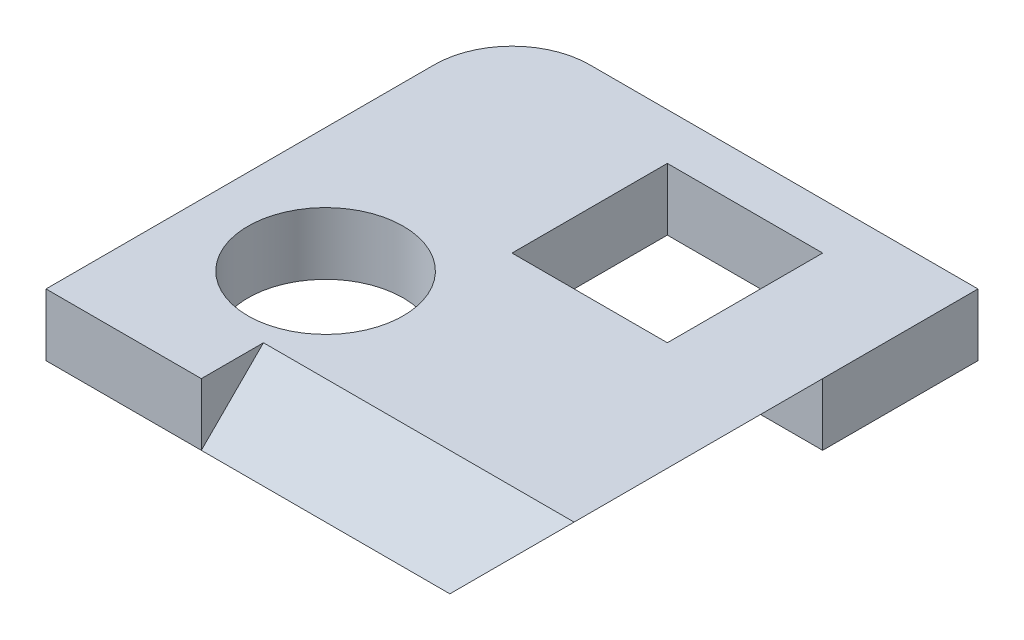
ISO-10303-21;
HEADER;
FILE_DESCRIPTION(('STEP AP214'),'2;1');
FILE_NAME('part.step','',(''),(''),'','','');
FILE_SCHEMA(('AUTOMOTIVE_DESIGN { 1 0 10303 214 1 1 1 1 }'));
ENDSEC;
DATA;
#1=APPLICATION_CONTEXT('core data for automotive mechanical design processes');
#2=APPLICATION_PROTOCOL_DEFINITION('international standard','automotive_design',2000,#1);
#3=PRODUCT_CONTEXT('',#1,'mechanical');
#4=PRODUCT('Part','Part','',(#3));
#5=PRODUCT_RELATED_PRODUCT_CATEGORY('part','',(#4));
#6=PRODUCT_DEFINITION_FORMATION('','',#4);
#7=PRODUCT_DEFINITION_CONTEXT('part definition',#1,'design');
#8=PRODUCT_DEFINITION('design','',#6,#7);
#9=PRODUCT_DEFINITION_SHAPE('','',#8);
#10=(LENGTH_UNIT() NAMED_UNIT(*) SI_UNIT(.MILLI.,.METRE.));
#11=(NAMED_UNIT(*) PLANE_ANGLE_UNIT() SI_UNIT($,.RADIAN.));
#12=(NAMED_UNIT(*) SI_UNIT($,.STERADIAN.) SOLID_ANGLE_UNIT());
#13=UNCERTAINTY_MEASURE_WITH_UNIT(LENGTH_MEASURE(1.E-05),#10,'distance_accuracy_value','');
#14=(GEOMETRIC_REPRESENTATION_CONTEXT(3) GLOBAL_UNCERTAINTY_ASSIGNED_CONTEXT((#13)) GLOBAL_UNIT_ASSIGNED_CONTEXT((#10,
#11,#12)) REPRESENTATION_CONTEXT('',''));
#15=CARTESIAN_POINT('',(0.,0.,0.));
#16=DIRECTION('',(0.,0.,1.));
#17=DIRECTION('',(1.,0.,0.));
#18=AXIS2_PLACEMENT_3D('',#15,#16,#17);
#19=CARTESIAN_POINT('',(0.,4.,0.));
#20=DIRECTION('',(1.,0.,0.));
#21=DIRECTION('',(0.,0.,-1.));
#22=AXIS2_PLACEMENT_3D('',#19,#20,#21);
#23=PLANE('',#22);
#24=DIRECTION('',(0.,0.,1.));
#25=VECTOR('',#24,1.);
#26=CARTESIAN_POINT('',(0.,4.,0.));
#27=LINE('',#26,#25);
#28=CARTESIAN_POINT('',(0.,4.,-25.));
#29=VERTEX_POINT('',#28);
#30=CARTESIAN_POINT('',(0.,4.,0.));
#31=VERTEX_POINT('',#30);
#32=EDGE_CURVE('E173',#29,#31,#27,.T.);
#33=ORIENTED_EDGE('',*,*,#32,.F.);
#34=DIRECTION('',(0.,-1.,0.));
#35=VECTOR('',#34,1.);
#36=CARTESIAN_POINT('',(0.,4.,-25.));
#37=LINE('',#36,#35);
#38=CARTESIAN_POINT('',(0.,0.,-25.));
#39=VERTEX_POINT('',#38);
#40=EDGE_CURVE('E178',#29,#39,#37,.T.);
#41=ORIENTED_EDGE('',*,*,#40,.T.);
#42=DIRECTION('',(0.,0.,1.));
#43=VECTOR('',#42,1.);
#44=CARTESIAN_POINT('',(0.,0.,0.));
#45=LINE('',#44,#43);
#46=CARTESIAN_POINT('',(0.,0.,0.));
#47=VERTEX_POINT('',#46);
#48=EDGE_CURVE('E163',#39,#47,#45,.T.);
#49=ORIENTED_EDGE('',*,*,#48,.T.);
#50=DIRECTION('',(0.,-1.,0.));
#51=VECTOR('',#50,1.);
#52=CARTESIAN_POINT('',(0.,4.,0.));
#53=LINE('',#52,#51);
#54=EDGE_CURVE('E175',#31,#47,#53,.T.);
#55=ORIENTED_EDGE('',*,*,#54,.F.);
#56=EDGE_LOOP('',(#33,#41,#49,#55));
#57=FACE_BOUND('',#56,.T.);
#58=ADVANCED_FACE('F37',(#57),#23,.F.);
#59=CARTESIAN_POINT('',(0.,4.,0.));
#60=DIRECTION('',(0.,0.,-1.));
#61=DIRECTION('',(-1.,0.,0.));
#62=AXIS2_PLACEMENT_3D('',#59,#60,#61);
#63=PLANE('',#62);
#64=DIRECTION('',(1.,0.,0.));
#65=VECTOR('',#64,1.);
#66=CARTESIAN_POINT('',(0.,0.,0.));
#67=LINE('',#66,#65);
#68=CARTESIAN_POINT('',(10.,0.,0.));
#69=VERTEX_POINT('',#68);
#70=EDGE_CURVE('E165',#47,#69,#67,.T.);
#71=ORIENTED_EDGE('',*,*,#70,.T.);
#72=DIRECTION('',(0.,-1.,0.));
#73=VECTOR('',#72,1.);
#74=CARTESIAN_POINT('',(10.,4.,0.));
#75=LINE('',#74,#73);
#76=CARTESIAN_POINT('',(10.,4.,0.));
#77=VERTEX_POINT('',#76);
#78=EDGE_CURVE('E52',#77,#69,#75,.T.);
#79=ORIENTED_EDGE('',*,*,#78,.F.);
#80=DIRECTION('',(1.,0.,0.));
#81=VECTOR('',#80,1.);
#82=CARTESIAN_POINT('',(0.,4.,0.));
#83=LINE('',#82,#81);
#84=EDGE_CURVE('E152',#31,#77,#83,.T.);
#85=ORIENTED_EDGE('',*,*,#84,.F.);
#86=ORIENTED_EDGE('',*,*,#54,.T.);
#87=EDGE_LOOP('',(#71,#79,#85,#86));
#88=FACE_BOUND('',#87,.T.);
#89=ADVANCED_FACE('F206',(#88),#63,.F.);
#90=CARTESIAN_POINT('',(30.,4.,0.));
#91=DIRECTION('',(-1.,0.,0.));
#92=DIRECTION('',(0.,0.,1.));
#93=AXIS2_PLACEMENT_3D('',#90,#91,#92);
#94=PLANE('',#93);
#95=DIRECTION('',(0.,0.,-1.));
#96=VECTOR('',#95,1.);
#97=CARTESIAN_POINT('',(30.,4.,0.));
#98=LINE('',#97,#96);
#99=CARTESIAN_POINT('',(30.,4.,-20.));
#100=VERTEX_POINT('',#99);
#101=CARTESIAN_POINT('',(30.,4.,-30.));
#102=VERTEX_POINT('',#101);
#103=EDGE_CURVE('E147',#100,#102,#98,.T.);
#104=ORIENTED_EDGE('',*,*,#103,.F.);
#105=DIRECTION('',(0.,1.,0.));
#106=VECTOR('',#105,1.);
#107=CARTESIAN_POINT('',(30.,0.,-20.));
#108=LINE('',#107,#106);
#109=CARTESIAN_POINT('',(30.,0.,-20.));
#110=VERTEX_POINT('',#109);
#111=EDGE_CURVE('E138',#110,#100,#108,.T.);
#112=ORIENTED_EDGE('',*,*,#111,.F.);
#113=DIRECTION('',(0.,0.,-1.));
#114=VECTOR('',#113,1.);
#115=CARTESIAN_POINT('',(30.,0.,0.));
#116=LINE('',#115,#114);
#117=CARTESIAN_POINT('',(30.,0.,-30.));
#118=VERTEX_POINT('',#117);
#119=EDGE_CURVE('E169',#110,#118,#116,.T.);
#120=ORIENTED_EDGE('',*,*,#119,.T.);
#121=DIRECTION('',(0.,-1.,0.));
#122=VECTOR('',#121,1.);
#123=CARTESIAN_POINT('',(30.,4.,-30.));
#124=LINE('',#123,#122);
#125=EDGE_CURVE('E150',#102,#118,#124,.T.);
#126=ORIENTED_EDGE('',*,*,#125,.F.);
#127=EDGE_LOOP('',(#104,#112,#120,#126));
#128=FACE_BOUND('',#127,.T.);
#129=ADVANCED_FACE('F148',(#128),#94,.F.);
#130=CARTESIAN_POINT('',(0.,4.,-30.));
#131=DIRECTION('',(0.,0.,1.));
#132=DIRECTION('',(1.,0.,0.));
#133=AXIS2_PLACEMENT_3D('',#130,#131,#132);
#134=PLANE('',#133);
#135=DIRECTION('',(-1.,0.,0.));
#136=VECTOR('',#135,1.);
#137=CARTESIAN_POINT('',(0.,0.,-30.));
#138=LINE('',#137,#136);
#139=CARTESIAN_POINT('',(5.,0.,-30.));
#140=VERTEX_POINT('',#139);
#141=EDGE_CURVE('E171',#118,#140,#138,.T.);
#142=ORIENTED_EDGE('',*,*,#141,.T.);
#143=DIRECTION('',(0.,-1.,0.));
#144=VECTOR('',#143,1.);
#145=CARTESIAN_POINT('',(5.,4.,-30.));
#146=LINE('',#145,#144);
#147=CARTESIAN_POINT('',(5.,4.,-30.));
#148=VERTEX_POINT('',#147);
#149=EDGE_CURVE('E60',#140,#148,#146,.F.);
#150=ORIENTED_EDGE('',*,*,#149,.T.);
#151=DIRECTION('',(-1.,0.,0.));
#152=VECTOR('',#151,1.);
#153=CARTESIAN_POINT('',(0.,4.,-30.));
#154=LINE('',#153,#152);
#155=EDGE_CURVE('E158',#102,#148,#154,.T.);
#156=ORIENTED_EDGE('',*,*,#155,.F.);
#157=ORIENTED_EDGE('',*,*,#125,.T.);
#158=EDGE_LOOP('',(#142,#150,#156,#157));
#159=FACE_BOUND('',#158,.T.);
#160=ADVANCED_FACE('F197',(#159),#134,.F.);
#161=CARTESIAN_POINT('',(0.,4.,0.));
#162=DIRECTION('',(0.,-1.,0.));
#163=DIRECTION('',(0.,0.,-1.));
#164=AXIS2_PLACEMENT_3D('',#161,#162,#163);
#165=PLANE('',#164);
#166=CARTESIAN_POINT('',(8.,4.,-10.));
#167=DIRECTION('',(0.,1.,0.));
#168=DIRECTION('',(0.,0.,1.));
#169=AXIS2_PLACEMENT_3D('',#166,#167,#168);
#170=CIRCLE('',#169,5.);
#171=CARTESIAN_POINT('',(8.,4.,-5.));
#172=VERTEX_POINT('',#171);
#173=EDGE_CURVE('E224',#172,#172,#170,.T.);
#174=ORIENTED_EDGE('',*,*,#173,.F.);
#175=EDGE_LOOP('',(#174));
#176=FACE_BOUND('',#175,.T.);
#177=DIRECTION('',(1.,0.,0.));
#178=VECTOR('',#177,1.);
#179=CARTESIAN_POINT('',(13.,4.,-17.));
#180=LINE('',#179,#178);
#181=CARTESIAN_POINT('',(13.,4.,-17.));
#182=VERTEX_POINT('',#181);
#183=CARTESIAN_POINT('',(23.,4.,-17.));
#184=VERTEX_POINT('',#183);
#185=EDGE_CURVE('E250',#182,#184,#180,.T.);
#186=ORIENTED_EDGE('',*,*,#185,.F.);
#187=DIRECTION('',(0.,0.,1.));
#188=VECTOR('',#187,1.);
#189=CARTESIAN_POINT('',(13.,4.,-27.));
#190=LINE('',#189,#188);
#191=CARTESIAN_POINT('',(13.,4.,-27.));
#192=VERTEX_POINT('',#191);
#193=EDGE_CURVE('E232',#192,#182,#190,.T.);
#194=ORIENTED_EDGE('',*,*,#193,.F.);
#195=DIRECTION('',(-1.,0.,0.));
#196=VECTOR('',#195,1.);
#197=CARTESIAN_POINT('',(13.,4.,-27.));
#198=LINE('',#197,#196);
#199=CARTESIAN_POINT('',(23.,4.,-27.));
#200=VERTEX_POINT('',#199);
#201=EDGE_CURVE('E239',#200,#192,#198,.T.);
#202=ORIENTED_EDGE('',*,*,#201,.F.);
#203=DIRECTION('',(0.,0.,-1.));
#204=VECTOR('',#203,1.);
#205=CARTESIAN_POINT('',(23.,4.,-27.));
#206=LINE('',#205,#204);
#207=EDGE_CURVE('E253',#184,#200,#206,.T.);
#208=ORIENTED_EDGE('',*,*,#207,.F.);
#209=EDGE_LOOP('',(#186,#194,#202,#208));
#210=FACE_BOUND('',#209,.T.);
#211=DIRECTION('',(0.,0.,1.));
#212=VECTOR('',#211,1.);
#213=CARTESIAN_POINT('',(10.,4.,-3.99999999999998));
#214=LINE('',#213,#212);
#215=CARTESIAN_POINT('',(10.,4.,-3.99999999999998));
#216=VERTEX_POINT('',#215);
#217=EDGE_CURVE('E221',#216,#77,#214,.T.);
#218=ORIENTED_EDGE('',*,*,#217,.F.);
#219=DIRECTION('',(1.,0.,0.));
#220=VECTOR('',#219,1.);
#221=CARTESIAN_POINT('',(10.,4.,-3.99999999999998));
#222=LINE('',#221,#220);
#223=CARTESIAN_POINT('',(30.,4.,-3.99999999999998));
#224=VERTEX_POINT('',#223);
#225=EDGE_CURVE('E157',#216,#224,#222,.T.);
#226=ORIENTED_EDGE('',*,*,#225,.T.);
#227=EDGE_CURVE('E132',#224,#100,#98,.T.);
#228=ORIENTED_EDGE('',*,*,#227,.T.);
#229=ORIENTED_EDGE('',*,*,#103,.T.);
#230=ORIENTED_EDGE('',*,*,#155,.T.);
#231=CARTESIAN_POINT('',(5.,4.,-25.));
#232=DIRECTION('',(0.,-1.,0.));
#233=DIRECTION('',(0.,0.,-1.));
#234=AXIS2_PLACEMENT_3D('',#231,#232,#233);
#235=CIRCLE('',#234,5.);
#236=EDGE_CURVE('E45',#148,#29,#235,.F.);
#237=ORIENTED_EDGE('',*,*,#236,.T.);
#238=ORIENTED_EDGE('',*,*,#32,.T.);
#239=ORIENTED_EDGE('',*,*,#84,.T.);
#240=EDGE_LOOP('',(#218,#226,#228,#229,#230,#237,#238,#239));
#241=FACE_BOUND('',#240,.T.);
#242=ADVANCED_FACE('F156',(#176,#210,#241),#165,.F.);
#243=CARTESIAN_POINT('',(0.,0.,0.));
#244=DIRECTION('',(0.,-1.,0.));
#245=DIRECTION('',(0.,0.,-1.));
#246=AXIS2_PLACEMENT_3D('',#243,#244,#245);
#247=PLANE('',#246);
#248=DIRECTION('',(0.,0.,1.));
#249=VECTOR('',#248,1.);
#250=CARTESIAN_POINT('',(26.,0.,-20.));
#251=LINE('',#250,#249);
#252=CARTESIAN_POINT('',(26.,0.,-20.));
#253=VERTEX_POINT('',#252);
#254=CARTESIAN_POINT('',(26.,0.,0.));
#255=VERTEX_POINT('',#254);
#256=EDGE_CURVE('E134',#253,#255,#251,.T.);
#257=ORIENTED_EDGE('',*,*,#256,.T.);
#258=DIRECTION('',(1.,0.,0.));
#259=VECTOR('',#258,1.);
#260=CARTESIAN_POINT('',(10.,0.,0.));
#261=LINE('',#260,#259);
#262=EDGE_CURVE('E219',#69,#255,#261,.T.);
#263=ORIENTED_EDGE('',*,*,#262,.F.);
#264=ORIENTED_EDGE('',*,*,#70,.F.);
#265=ORIENTED_EDGE('',*,*,#48,.F.);
#266=CARTESIAN_POINT('',(5.,0.,-25.));
#267=DIRECTION('',(0.,-1.,0.));
#268=DIRECTION('',(0.,0.,-1.));
#269=AXIS2_PLACEMENT_3D('',#266,#267,#268);
#270=CIRCLE('',#269,5.);
#271=EDGE_CURVE('E181',#39,#140,#270,.T.);
#272=ORIENTED_EDGE('',*,*,#271,.T.);
#273=ORIENTED_EDGE('',*,*,#141,.F.);
#274=ORIENTED_EDGE('',*,*,#119,.F.);
#275=DIRECTION('',(1.,0.,0.));
#276=VECTOR('',#275,1.);
#277=CARTESIAN_POINT('',(26.,0.,-20.));
#278=LINE('',#277,#276);
#279=EDGE_CURVE('E137',#253,#110,#278,.T.);
#280=ORIENTED_EDGE('',*,*,#279,.F.);
#281=EDGE_LOOP('',(#257,#263,#264,#265,#272,#273,#274,#280));
#282=FACE_BOUND('',#281,.T.);
#283=CARTESIAN_POINT('',(8.,0.,-10.));
#284=DIRECTION('',(0.,1.,0.));
#285=DIRECTION('',(0.,0.,1.));
#286=AXIS2_PLACEMENT_3D('',#283,#284,#285);
#287=CIRCLE('',#286,5.);
#288=CARTESIAN_POINT('',(8.,0.,-5.));
#289=VERTEX_POINT('',#288);
#290=EDGE_CURVE('E229',#289,#289,#287,.T.);
#291=ORIENTED_EDGE('',*,*,#290,.T.);
#292=EDGE_LOOP('',(#291));
#293=FACE_BOUND('',#292,.T.);
#294=DIRECTION('',(0.,0.,1.));
#295=VECTOR('',#294,1.);
#296=CARTESIAN_POINT('',(13.,0.,-27.));
#297=LINE('',#296,#295);
#298=CARTESIAN_POINT('',(13.,0.,-27.));
#299=VERTEX_POINT('',#298);
#300=CARTESIAN_POINT('',(13.,0.,-17.));
#301=VERTEX_POINT('',#300);
#302=EDGE_CURVE('E235',#299,#301,#297,.T.);
#303=ORIENTED_EDGE('',*,*,#302,.T.);
#304=DIRECTION('',(1.,0.,0.));
#305=VECTOR('',#304,1.);
#306=CARTESIAN_POINT('',(13.,0.,-17.));
#307=LINE('',#306,#305);
#308=CARTESIAN_POINT('',(23.,0.,-17.));
#309=VERTEX_POINT('',#308);
#310=EDGE_CURVE('E238',#301,#309,#307,.T.);
#311=ORIENTED_EDGE('',*,*,#310,.T.);
#312=DIRECTION('',(0.,0.,-1.));
#313=VECTOR('',#312,1.);
#314=CARTESIAN_POINT('',(23.,0.,-27.));
#315=LINE('',#314,#313);
#316=CARTESIAN_POINT('',(23.,0.,-27.));
#317=VERTEX_POINT('',#316);
#318=EDGE_CURVE('E242',#309,#317,#315,.T.);
#319=ORIENTED_EDGE('',*,*,#318,.T.);
#320=DIRECTION('',(-1.,0.,0.));
#321=VECTOR('',#320,1.);
#322=CARTESIAN_POINT('',(13.,0.,-27.));
#323=LINE('',#322,#321);
#324=EDGE_CURVE('E245',#317,#299,#323,.T.);
#325=ORIENTED_EDGE('',*,*,#324,.T.);
#326=EDGE_LOOP('',(#303,#311,#319,#325));
#327=FACE_BOUND('',#326,.T.);
#328=ADVANCED_FACE('F194',(#282,#293,#327),#247,.T.);
#329=CARTESIAN_POINT('',(13.,0.,-27.));
#330=DIRECTION('',(-1.,0.,0.));
#331=DIRECTION('',(0.,0.,1.));
#332=AXIS2_PLACEMENT_3D('',#329,#330,#331);
#333=PLANE('',#332);
#334=ORIENTED_EDGE('',*,*,#193,.T.);
#335=DIRECTION('',(0.,1.,0.));
#336=VECTOR('',#335,1.);
#337=CARTESIAN_POINT('',(13.,0.,-17.));
#338=LINE('',#337,#336);
#339=EDGE_CURVE('E248',#301,#182,#338,.T.);
#340=ORIENTED_EDGE('',*,*,#339,.F.);
#341=ORIENTED_EDGE('',*,*,#302,.F.);
#342=DIRECTION('',(0.,1.,0.));
#343=VECTOR('',#342,1.);
#344=CARTESIAN_POINT('',(13.,0.,-27.));
#345=LINE('',#344,#343);
#346=EDGE_CURVE('E166',#299,#192,#345,.T.);
#347=ORIENTED_EDGE('',*,*,#346,.T.);
#348=EDGE_LOOP('',(#334,#340,#341,#347));
#349=FACE_BOUND('',#348,.T.);
#350=ADVANCED_FACE('F279',(#349),#333,.F.);
#351=CARTESIAN_POINT('',(13.,0.,-27.));
#352=DIRECTION('',(0.,0.,-1.));
#353=DIRECTION('',(-1.,0.,0.));
#354=AXIS2_PLACEMENT_3D('',#351,#352,#353);
#355=PLANE('',#354);
#356=ORIENTED_EDGE('',*,*,#201,.T.);
#357=ORIENTED_EDGE('',*,*,#346,.F.);
#358=ORIENTED_EDGE('',*,*,#324,.F.);
#359=DIRECTION('',(0.,1.,0.));
#360=VECTOR('',#359,1.);
#361=CARTESIAN_POINT('',(23.,0.,-27.));
#362=LINE('',#361,#360);
#363=EDGE_CURVE('E259',#317,#200,#362,.T.);
#364=ORIENTED_EDGE('',*,*,#363,.T.);
#365=EDGE_LOOP('',(#356,#357,#358,#364));
#366=FACE_BOUND('',#365,.T.);
#367=ADVANCED_FACE('F281',(#366),#355,.F.);
#368=CARTESIAN_POINT('',(23.,0.,-27.));
#369=DIRECTION('',(1.,0.,0.));
#370=DIRECTION('',(0.,0.,-1.));
#371=AXIS2_PLACEMENT_3D('',#368,#369,#370);
#372=PLANE('',#371);
#373=ORIENTED_EDGE('',*,*,#207,.T.);
#374=ORIENTED_EDGE('',*,*,#363,.F.);
#375=ORIENTED_EDGE('',*,*,#318,.F.);
#376=DIRECTION('',(0.,1.,0.));
#377=VECTOR('',#376,1.);
#378=CARTESIAN_POINT('',(23.,0.,-17.));
#379=LINE('',#378,#377);
#380=EDGE_CURVE('E261',#309,#184,#379,.T.);
#381=ORIENTED_EDGE('',*,*,#380,.T.);
#382=EDGE_LOOP('',(#373,#374,#375,#381));
#383=FACE_BOUND('',#382,.T.);
#384=ADVANCED_FACE('F276',(#383),#372,.F.);
#385=CARTESIAN_POINT('',(13.,0.,-17.));
#386=DIRECTION('',(0.,0.,1.));
#387=DIRECTION('',(1.,0.,0.));
#388=AXIS2_PLACEMENT_3D('',#385,#386,#387);
#389=PLANE('',#388);
#390=ORIENTED_EDGE('',*,*,#185,.T.);
#391=ORIENTED_EDGE('',*,*,#380,.F.);
#392=ORIENTED_EDGE('',*,*,#310,.F.);
#393=ORIENTED_EDGE('',*,*,#339,.T.);
#394=EDGE_LOOP('',(#390,#391,#392,#393));
#395=FACE_BOUND('',#394,.T.);
#396=ADVANCED_FACE('F267',(#395),#389,.F.);
#397=CARTESIAN_POINT('',(8.,0.,-10.));
#398=DIRECTION('',(0.,1.,0.));
#399=DIRECTION('',(0.,0.,1.));
#400=AXIS2_PLACEMENT_3D('',#397,#398,#399);
#401=CYLINDRICAL_SURFACE('',#400,5.);
#402=ORIENTED_EDGE('',*,*,#290,.F.);
#403=EDGE_LOOP('',(#402));
#404=FACE_BOUND('',#403,.T.);
#405=ORIENTED_EDGE('',*,*,#173,.T.);
#406=EDGE_LOOP('',(#405));
#407=FACE_BOUND('',#406,.T.);
#408=ADVANCED_FACE('F291',(#404,#407),#401,.F.);
#409=CARTESIAN_POINT('',(5.,4.,-25.));
#410=DIRECTION('',(0.,-1.,0.));
#411=DIRECTION('',(0.,0.,-1.));
#412=AXIS2_PLACEMENT_3D('',#409,#410,#411);
#413=CYLINDRICAL_SURFACE('',#412,5.);
#414=ORIENTED_EDGE('',*,*,#236,.F.);
#415=ORIENTED_EDGE('',*,*,#149,.F.);
#416=ORIENTED_EDGE('',*,*,#271,.F.);
#417=ORIENTED_EDGE('',*,*,#40,.F.);
#418=EDGE_LOOP('',(#414,#415,#416,#417));
#419=FACE_BOUND('',#418,.T.);
#420=ADVANCED_FACE('F39',(#419),#413,.T.);
#421=CARTESIAN_POINT('',(10.,0.,0.));
#422=DIRECTION('',(0.,-0.707106781186546,-0.707106781186549));
#423=DIRECTION('',(0.,0.707106781186549,-0.707106781186546));
#424=AXIS2_PLACEMENT_3D('',#421,#422,#423);
#425=PLANE('',#424);
#426=ORIENTED_EDGE('',*,*,#262,.T.);
#427=DIRECTION('',(0.577350269189631,0.577350269189625,-0.577350269189622));
#428=VECTOR('',#427,1.);
#429=CARTESIAN_POINT('',(20.6666666666665,-5.33333333333335,5.33333333333333));
#430=LINE('',#429,#428);
#431=EDGE_CURVE('E11',#255,#224,#430,.T.);
#432=ORIENTED_EDGE('',*,*,#431,.T.);
#433=ORIENTED_EDGE('',*,*,#225,.F.);
#434=DIRECTION('',(0.,0.707106781186549,-0.707106781186546));
#435=VECTOR('',#434,1.);
#436=CARTESIAN_POINT('',(10.,0.,0.));
#437=LINE('',#436,#435);
#438=EDGE_CURVE('E226',#69,#216,#437,.T.);
#439=ORIENTED_EDGE('',*,*,#438,.F.);
#440=EDGE_LOOP('',(#426,#432,#433,#439));
#441=FACE_BOUND('',#440,.T.);
#442=ADVANCED_FACE('F347',(#441),#425,.F.);
#443=CARTESIAN_POINT('',(10.,0.,0.));
#444=DIRECTION('',(-1.,0.,0.));
#445=DIRECTION('',(0.,0.,1.));
#446=AXIS2_PLACEMENT_3D('',#443,#444,#445);
#447=PLANE('',#446);
#448=ORIENTED_EDGE('',*,*,#78,.T.);
#449=ORIENTED_EDGE('',*,*,#438,.T.);
#450=ORIENTED_EDGE('',*,*,#217,.T.);
#451=EDGE_LOOP('',(#448,#449,#450));
#452=FACE_BOUND('',#451,.T.);
#453=ADVANCED_FACE('F357',(#452),#447,.F.);
#454=CARTESIAN_POINT('',(30.,4.,-20.));
#455=DIRECTION('',(-0.707106781186544,0.707106781186551,0.));
#456=DIRECTION('',(-0.707106781186551,-0.707106781186544,0.));
#457=AXIS2_PLACEMENT_3D('',#454,#455,#456);
#458=PLANE('',#457);
#459=ORIENTED_EDGE('',*,*,#256,.F.);
#460=DIRECTION('',(-0.707106781186551,-0.707106781186544,0.));
#461=VECTOR('',#460,1.);
#462=CARTESIAN_POINT('',(30.,4.,-20.));
#463=LINE('',#462,#461);
#464=EDGE_CURVE('E128',#100,#253,#463,.T.);
#465=ORIENTED_EDGE('',*,*,#464,.F.);
#466=ORIENTED_EDGE('',*,*,#227,.F.);
#467=ORIENTED_EDGE('',*,*,#431,.F.);
#468=EDGE_LOOP('',(#459,#465,#466,#467));
#469=FACE_BOUND('',#468,.T.);
#470=ADVANCED_FACE('F130',(#469),#458,.F.);
#471=CARTESIAN_POINT('',(0.,0.,-20.));
#472=DIRECTION('',(0.,0.,-1.));
#473=DIRECTION('',(-1.,0.,0.));
#474=AXIS2_PLACEMENT_3D('',#471,#472,#473);
#475=PLANE('',#474);
#476=ORIENTED_EDGE('',*,*,#111,.T.);
#477=ORIENTED_EDGE('',*,*,#464,.T.);
#478=ORIENTED_EDGE('',*,*,#279,.T.);
#479=EDGE_LOOP('',(#476,#477,#478));
#480=FACE_BOUND('',#479,.T.);
#481=ADVANCED_FACE('F142',(#480),#475,.F.);
#482=CLOSED_SHELL('',(#58,#89,#129,#160,#242,#328,#350,#367,#384,#396,#408,#420,#442,#453,#470,#481));
#483=MANIFOLD_SOLID_BREP('B2',#482);
#484=ADVANCED_BREP_SHAPE_REPRESENTATION('',(#18,#483),#14);
#485=SHAPE_DEFINITION_REPRESENTATION(#9,#484);
ENDSEC;
END-ISO-10303-21;
